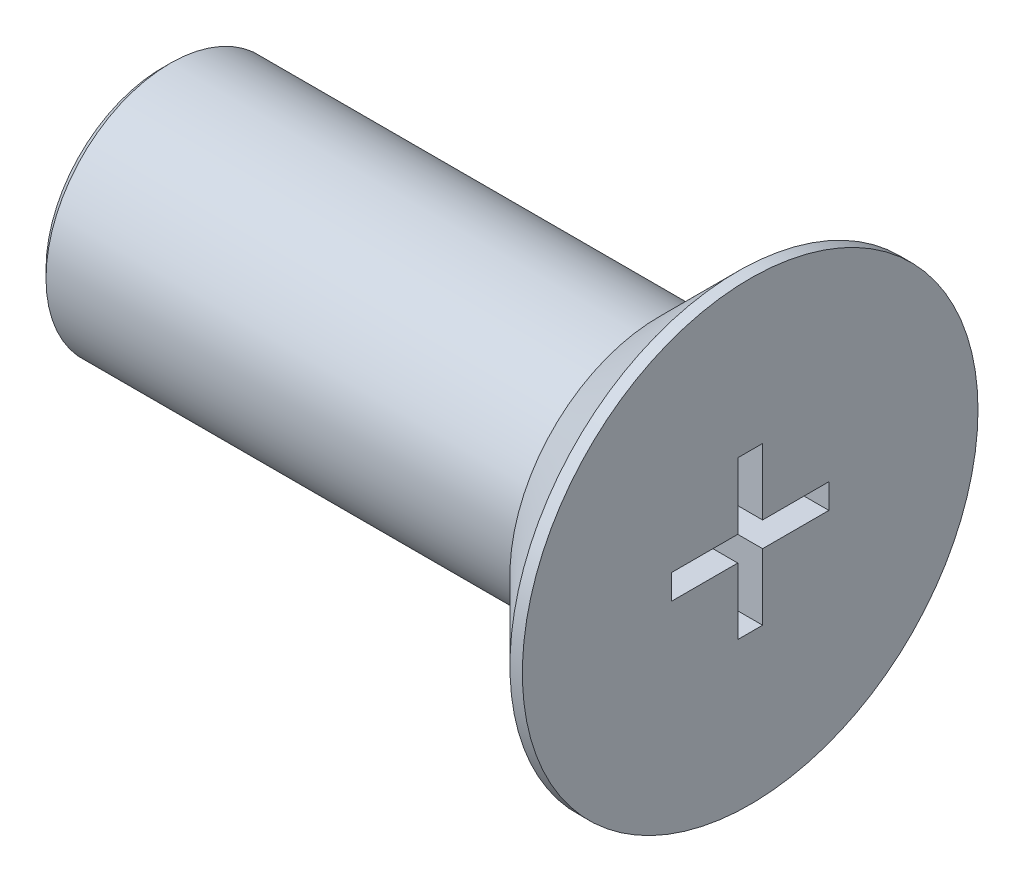
ISO-10303-21;
HEADER;
FILE_DESCRIPTION(('STEP AP214'),'2;1');
FILE_NAME('part.step','',(''),(''),'','','');
FILE_SCHEMA(('AUTOMOTIVE_DESIGN { 1 0 10303 214 1 1 1 1 }'));
ENDSEC;
DATA;
#1=APPLICATION_CONTEXT('core data for automotive mechanical design processes');
#2=APPLICATION_PROTOCOL_DEFINITION('international standard','automotive_design',2000,#1);
#3=PRODUCT_CONTEXT('',#1,'mechanical');
#4=PRODUCT('Part','Part','',(#3));
#5=PRODUCT_RELATED_PRODUCT_CATEGORY('part','',(#4));
#6=PRODUCT_DEFINITION_FORMATION('','',#4);
#7=PRODUCT_DEFINITION_CONTEXT('part definition',#1,'design');
#8=PRODUCT_DEFINITION('design','',#6,#7);
#9=PRODUCT_DEFINITION_SHAPE('','',#8);
#10=(LENGTH_UNIT() NAMED_UNIT(*) SI_UNIT(.MILLI.,.METRE.));
#11=(NAMED_UNIT(*) PLANE_ANGLE_UNIT() SI_UNIT($,.RADIAN.));
#12=(NAMED_UNIT(*) SI_UNIT($,.STERADIAN.) SOLID_ANGLE_UNIT());
#13=UNCERTAINTY_MEASURE_WITH_UNIT(LENGTH_MEASURE(1.E-05),#10,'distance_accuracy_value','');
#14=(GEOMETRIC_REPRESENTATION_CONTEXT(3) GLOBAL_UNCERTAINTY_ASSIGNED_CONTEXT((#13)) GLOBAL_UNIT_ASSIGNED_CONTEXT((#10,
#11,#12)) REPRESENTATION_CONTEXT('',''));
#15=CARTESIAN_POINT('',(0.,0.,0.));
#16=DIRECTION('',(0.,0.,1.));
#17=DIRECTION('',(1.,0.,0.));
#18=AXIS2_PLACEMENT_3D('',#15,#16,#17);
#19=CARTESIAN_POINT('',(0.,0.,0.));
#20=DIRECTION('',(1.,0.,0.));
#21=DIRECTION('',(0.,0.,-1.));
#22=AXIS2_PLACEMENT_3D('',#19,#20,#21);
#23=PLANE('',#22);
#24=CARTESIAN_POINT('',(0.,0.,0.));
#25=DIRECTION('',(1.,0.,0.));
#26=DIRECTION('',(0.,0.,-1.));
#27=AXIS2_PLACEMENT_3D('',#24,#25,#26);
#28=CIRCLE('',#27,3.6);
#29=CARTESIAN_POINT('',(0.,0.,-3.6));
#30=VERTEX_POINT('',#29);
#31=EDGE_CURVE('E11',#30,#30,#28,.F.);
#32=ORIENTED_EDGE('',*,*,#31,.T.);
#33=EDGE_LOOP('',(#32));
#34=FACE_BOUND('',#33,.T.);
#35=CARTESIAN_POINT('',(0.,0.,0.));
#36=DIRECTION('',(1.,0.,0.));
#37=DIRECTION('',(0.,0.,-1.));
#38=AXIS2_PLACEMENT_3D('',#35,#36,#37);
#39=CIRCLE('',#38,3.);
#40=CARTESIAN_POINT('',(0.,0.,-3.));
#41=VERTEX_POINT('',#40);
#42=EDGE_CURVE('E213',#41,#41,#39,.F.);
#43=ORIENTED_EDGE('',*,*,#42,.F.);
#44=EDGE_LOOP('',(#43));
#45=FACE_BOUND('',#44,.T.);
#46=ADVANCED_FACE('F37',(#34,#45),#23,.F.);
#47=CARTESIAN_POINT('',(2.2,0.,0.));
#48=DIRECTION('',(-1.,0.,0.));
#49=DIRECTION('',(0.,0.,1.));
#50=AXIS2_PLACEMENT_3D('',#47,#48,#49);
#51=CYLINDRICAL_SURFACE('',#50,5.5);
#52=CARTESIAN_POINT('',(1.9,0.,0.));
#53=DIRECTION('',(1.,0.,0.));
#54=DIRECTION('',(0.,0.,-1.));
#55=AXIS2_PLACEMENT_3D('',#52,#53,#54);
#56=CIRCLE('',#55,5.5);
#57=CARTESIAN_POINT('',(1.9,0.,-5.5));
#58=VERTEX_POINT('',#57);
#59=EDGE_CURVE('E45',#58,#58,#56,.T.);
#60=ORIENTED_EDGE('',*,*,#59,.T.);
#61=EDGE_LOOP('',(#60));
#62=FACE_BOUND('',#61,.T.);
#63=CARTESIAN_POINT('',(2.2,0.,0.));
#64=DIRECTION('',(1.,0.,0.));
#65=DIRECTION('',(0.,0.,-1.));
#66=AXIS2_PLACEMENT_3D('',#63,#64,#65);
#67=CIRCLE('',#66,5.5);
#68=CARTESIAN_POINT('',(2.2,0.,-5.5));
#69=VERTEX_POINT('',#68);
#70=EDGE_CURVE('E193',#69,#69,#67,.T.);
#71=ORIENTED_EDGE('',*,*,#70,.F.);
#72=EDGE_LOOP('',(#71));
#73=FACE_BOUND('',#72,.T.);
#74=ADVANCED_FACE('F224',(#62,#73),#51,.T.);
#75=CARTESIAN_POINT('',(2.2,0.,0.));
#76=DIRECTION('',(1.,0.,0.));
#77=DIRECTION('',(0.,0.,-1.));
#78=AXIS2_PLACEMENT_3D('',#75,#76,#77);
#79=PLANE('',#78);
#80=DIRECTION('',(0.,1.,0.));
#81=VECTOR('',#80,1.);
#82=CARTESIAN_POINT('',(2.2,1.9,-0.3));
#83=LINE('',#82,#81);
#84=CARTESIAN_POINT('',(2.2,0.3,-0.3));
#85=VERTEX_POINT('',#84);
#86=CARTESIAN_POINT('',(2.2,1.9,-0.3));
#87=VERTEX_POINT('',#86);
#88=EDGE_CURVE('E52',#85,#87,#83,.T.);
#89=ORIENTED_EDGE('',*,*,#88,.F.);
#90=DIRECTION('',(0.,0.,1.));
#91=VECTOR('',#90,1.);
#92=CARTESIAN_POINT('',(2.2,0.3,-0.3));
#93=LINE('',#92,#91);
#94=CARTESIAN_POINT('',(2.2,0.3,-1.9));
#95=VERTEX_POINT('',#94);
#96=EDGE_CURVE('E189',#95,#85,#93,.T.);
#97=ORIENTED_EDGE('',*,*,#96,.F.);
#98=DIRECTION('',(0.,1.,0.));
#99=VECTOR('',#98,1.);
#100=CARTESIAN_POINT('',(2.2,0.3,-1.9));
#101=LINE('',#100,#99);
#102=CARTESIAN_POINT('',(2.2,-0.3,-1.9));
#103=VERTEX_POINT('',#102);
#104=EDGE_CURVE('E187',#103,#95,#101,.T.);
#105=ORIENTED_EDGE('',*,*,#104,.F.);
#106=DIRECTION('',(0.,0.,-1.));
#107=VECTOR('',#106,1.);
#108=CARTESIAN_POINT('',(2.2,-0.3,-1.9));
#109=LINE('',#108,#107);
#110=CARTESIAN_POINT('',(2.2,-0.3,-0.3));
#111=VERTEX_POINT('',#110);
#112=EDGE_CURVE('E136',#111,#103,#109,.T.);
#113=ORIENTED_EDGE('',*,*,#112,.F.);
#114=DIRECTION('',(0.,1.,0.));
#115=VECTOR('',#114,1.);
#116=CARTESIAN_POINT('',(2.2,-0.3,-0.3));
#117=LINE('',#116,#115);
#118=CARTESIAN_POINT('',(2.2,-1.9,-0.3));
#119=VERTEX_POINT('',#118);
#120=EDGE_CURVE('E183',#119,#111,#117,.T.);
#121=ORIENTED_EDGE('',*,*,#120,.F.);
#122=DIRECTION('',(0.,0.,-1.));
#123=VECTOR('',#122,1.);
#124=CARTESIAN_POINT('',(2.2,-1.9,-0.3));
#125=LINE('',#124,#123);
#126=CARTESIAN_POINT('',(2.2,-1.9,0.3));
#127=VERTEX_POINT('',#126);
#128=EDGE_CURVE('E180',#127,#119,#125,.T.);
#129=ORIENTED_EDGE('',*,*,#128,.F.);
#130=DIRECTION('',(0.,-1.,0.));
#131=VECTOR('',#130,1.);
#132=CARTESIAN_POINT('',(2.2,-1.9,0.3));
#133=LINE('',#132,#131);
#134=CARTESIAN_POINT('',(2.2,-0.3,0.3));
#135=VERTEX_POINT('',#134);
#136=EDGE_CURVE('E177',#135,#127,#133,.T.);
#137=ORIENTED_EDGE('',*,*,#136,.F.);
#138=DIRECTION('',(0.,0.,-1.));
#139=VECTOR('',#138,1.);
#140=CARTESIAN_POINT('',(2.2,-0.3,0.3));
#141=LINE('',#140,#139);
#142=CARTESIAN_POINT('',(2.2,-0.3,1.9));
#143=VERTEX_POINT('',#142);
#144=EDGE_CURVE('E174',#143,#135,#141,.T.);
#145=ORIENTED_EDGE('',*,*,#144,.F.);
#146=DIRECTION('',(0.,-1.,0.));
#147=VECTOR('',#146,1.);
#148=CARTESIAN_POINT('',(2.2,-0.3,1.9));
#149=LINE('',#148,#147);
#150=CARTESIAN_POINT('',(2.2,0.3,1.9));
#151=VERTEX_POINT('',#150);
#152=EDGE_CURVE('E171',#151,#143,#149,.T.);
#153=ORIENTED_EDGE('',*,*,#152,.F.);
#154=DIRECTION('',(0.,0.,1.));
#155=VECTOR('',#154,1.);
#156=CARTESIAN_POINT('',(2.2,0.3,1.9));
#157=LINE('',#156,#155);
#158=CARTESIAN_POINT('',(2.2,0.3,0.3));
#159=VERTEX_POINT('',#158);
#160=EDGE_CURVE('E168',#159,#151,#157,.T.);
#161=ORIENTED_EDGE('',*,*,#160,.F.);
#162=DIRECTION('',(0.,-1.,0.));
#163=VECTOR('',#162,1.);
#164=CARTESIAN_POINT('',(2.2,0.3,0.3));
#165=LINE('',#164,#163);
#166=CARTESIAN_POINT('',(2.2,1.9,0.3));
#167=VERTEX_POINT('',#166);
#168=EDGE_CURVE('E165',#167,#159,#165,.T.);
#169=ORIENTED_EDGE('',*,*,#168,.F.);
#170=DIRECTION('',(0.,0.,1.));
#171=VECTOR('',#170,1.);
#172=CARTESIAN_POINT('',(2.2,1.9,0.3));
#173=LINE('',#172,#171);
#174=EDGE_CURVE('E162',#87,#167,#173,.T.);
#175=ORIENTED_EDGE('',*,*,#174,.F.);
#176=EDGE_LOOP('',(#89,#97,#105,#113,#121,#129,#137,#145,#153,#161,#169,#175));
#177=FACE_BOUND('',#176,.T.);
#178=ORIENTED_EDGE('',*,*,#70,.T.);
#179=EDGE_LOOP('',(#178));
#180=FACE_BOUND('',#179,.T.);
#181=ADVANCED_FACE('F246',(#177,#180),#79,.T.);
#182=CARTESIAN_POINT('',(-12.,0.,0.));
#183=DIRECTION('',(1.,0.,0.));
#184=DIRECTION('',(0.,0.,-1.));
#185=AXIS2_PLACEMENT_3D('',#182,#183,#184);
#186=CYLINDRICAL_SURFACE('',#185,3.);
#187=CARTESIAN_POINT('',(-11.8,0.,0.));
#188=DIRECTION('',(-1.,0.,0.));
#189=DIRECTION('',(0.,0.,1.));
#190=AXIS2_PLACEMENT_3D('',#187,#188,#189);
#191=CIRCLE('',#190,3.);
#192=CARTESIAN_POINT('',(-11.8,0.,3.));
#193=VERTEX_POINT('',#192);
#194=EDGE_CURVE('E219',#193,#193,#191,.F.);
#195=ORIENTED_EDGE('',*,*,#194,.T.);
#196=EDGE_LOOP('',(#195));
#197=FACE_BOUND('',#196,.T.);
#198=ORIENTED_EDGE('',*,*,#42,.T.);
#199=EDGE_LOOP('',(#198));
#200=FACE_BOUND('',#199,.T.);
#201=ADVANCED_FACE('F252',(#197,#200),#186,.T.);
#202=CARTESIAN_POINT('',(-12.,0.,0.));
#203=DIRECTION('',(-1.,0.,0.));
#204=DIRECTION('',(0.,0.,1.));
#205=AXIS2_PLACEMENT_3D('',#202,#203,#204);
#206=PLANE('',#205);
#207=CARTESIAN_POINT('',(-12.,0.,0.));
#208=DIRECTION('',(-1.,0.,0.));
#209=DIRECTION('',(0.,0.,1.));
#210=AXIS2_PLACEMENT_3D('',#207,#208,#209);
#211=CIRCLE('',#210,2.8);
#212=CARTESIAN_POINT('',(-12.,0.,2.8));
#213=VERTEX_POINT('',#212);
#214=EDGE_CURVE('E216',#213,#213,#211,.T.);
#215=ORIENTED_EDGE('',*,*,#214,.T.);
#216=EDGE_LOOP('',(#215));
#217=FACE_BOUND('',#216,.T.);
#218=ADVANCED_FACE('F237',(#217),#206,.T.);
#219=CARTESIAN_POINT('',(-12.,0.,0.));
#220=DIRECTION('',(1.,0.,0.));
#221=DIRECTION('',(0.,0.,-1.));
#222=AXIS2_PLACEMENT_3D('',#219,#220,#221);
#223=CONICAL_SURFACE('',#222,2.8,0.785398163397452);
#224=ORIENTED_EDGE('',*,*,#194,.F.);
#225=EDGE_LOOP('',(#224));
#226=FACE_BOUND('',#225,.T.);
#227=ORIENTED_EDGE('',*,*,#214,.F.);
#228=EDGE_LOOP('',(#227));
#229=FACE_BOUND('',#228,.T.);
#230=ADVANCED_FACE('F229',(#226,#229),#223,.T.);
#231=CARTESIAN_POINT('',(1.9,0.,0.));
#232=DIRECTION('',(1.,0.,0.));
#233=DIRECTION('',(0.,0.,-1.));
#234=AXIS2_PLACEMENT_3D('',#231,#232,#233);
#235=CONICAL_SURFACE('',#234,5.5,0.785398163397449);
#236=ORIENTED_EDGE('',*,*,#31,.F.);
#237=EDGE_LOOP('',(#236));
#238=FACE_BOUND('',#237,.T.);
#239=ORIENTED_EDGE('',*,*,#59,.F.);
#240=EDGE_LOOP('',(#239));
#241=FACE_BOUND('',#240,.T.);
#242=ADVANCED_FACE('F39',(#238,#241),#235,.T.);
#243=CARTESIAN_POINT('',(-0.8,1.9,-0.3));
#244=DIRECTION('',(0.,0.,-1.));
#245=DIRECTION('',(0.,1.,0.));
#246=AXIS2_PLACEMENT_3D('',#243,#244,#245);
#247=PLANE('',#246);
#248=ORIENTED_EDGE('',*,*,#88,.T.);
#249=DIRECTION('',(1.,0.,0.));
#250=VECTOR('',#249,1.);
#251=CARTESIAN_POINT('',(-0.8,1.9,-0.3));
#252=LINE('',#251,#250);
#253=CARTESIAN_POINT('',(-0.8,1.9,-0.3));
#254=VERTEX_POINT('',#253);
#255=EDGE_CURVE('E100',#254,#87,#252,.T.);
#256=ORIENTED_EDGE('',*,*,#255,.F.);
#257=DIRECTION('',(0.,1.,0.));
#258=VECTOR('',#257,1.);
#259=CARTESIAN_POINT('',(-0.8,1.9,-0.3));
#260=LINE('',#259,#258);
#261=CARTESIAN_POINT('',(-0.8,0.3,-0.3));
#262=VERTEX_POINT('',#261);
#263=EDGE_CURVE('E191',#262,#254,#260,.T.);
#264=ORIENTED_EDGE('',*,*,#263,.F.);
#265=DIRECTION('',(1.,0.,0.));
#266=VECTOR('',#265,1.);
#267=CARTESIAN_POINT('',(-0.8,0.3,-0.3));
#268=LINE('',#267,#266);
#269=EDGE_CURVE('E60',#262,#85,#268,.T.);
#270=ORIENTED_EDGE('',*,*,#269,.T.);
#271=EDGE_LOOP('',(#248,#256,#264,#270));
#272=FACE_BOUND('',#271,.T.);
#273=ADVANCED_FACE('F228',(#272),#247,.F.);
#274=CARTESIAN_POINT('',(-0.8,0.3,-0.3));
#275=DIRECTION('',(0.,1.,0.));
#276=DIRECTION('',(0.,0.,1.));
#277=AXIS2_PLACEMENT_3D('',#274,#275,#276);
#278=PLANE('',#277);
#279=ORIENTED_EDGE('',*,*,#96,.T.);
#280=ORIENTED_EDGE('',*,*,#269,.F.);
#281=DIRECTION('',(0.,0.,1.));
#282=VECTOR('',#281,1.);
#283=CARTESIAN_POINT('',(-0.8,0.3,-0.3));
#284=LINE('',#283,#282);
#285=CARTESIAN_POINT('',(-0.8,0.3,-1.9));
#286=VERTEX_POINT('',#285);
#287=EDGE_CURVE('E148',#286,#262,#284,.T.);
#288=ORIENTED_EDGE('',*,*,#287,.F.);
#289=DIRECTION('',(1.,0.,0.));
#290=VECTOR('',#289,1.);
#291=CARTESIAN_POINT('',(-0.8,0.3,-1.9));
#292=LINE('',#291,#290);
#293=EDGE_CURVE('E140',#286,#95,#292,.T.);
#294=ORIENTED_EDGE('',*,*,#293,.T.);
#295=EDGE_LOOP('',(#279,#280,#288,#294));
#296=FACE_BOUND('',#295,.T.);
#297=ADVANCED_FACE('F235',(#296),#278,.F.);
#298=CARTESIAN_POINT('',(-0.8,0.3,-1.9));
#299=DIRECTION('',(0.,0.,-1.));
#300=DIRECTION('',(-1.,0.,0.));
#301=AXIS2_PLACEMENT_3D('',#298,#299,#300);
#302=PLANE('',#301);
#303=ORIENTED_EDGE('',*,*,#104,.T.);
#304=ORIENTED_EDGE('',*,*,#293,.F.);
#305=DIRECTION('',(0.,1.,0.));
#306=VECTOR('',#305,1.);
#307=CARTESIAN_POINT('',(-0.8,0.3,-1.9));
#308=LINE('',#307,#306);
#309=CARTESIAN_POINT('',(-0.8,-0.3,-1.9));
#310=VERTEX_POINT('',#309);
#311=EDGE_CURVE('E144',#310,#286,#308,.T.);
#312=ORIENTED_EDGE('',*,*,#311,.F.);
#313=DIRECTION('',(1.,0.,0.));
#314=VECTOR('',#313,1.);
#315=CARTESIAN_POINT('',(-0.8,-0.3,-1.9));
#316=LINE('',#315,#314);
#317=EDGE_CURVE('E129',#310,#103,#316,.T.);
#318=ORIENTED_EDGE('',*,*,#317,.T.);
#319=EDGE_LOOP('',(#303,#304,#312,#318));
#320=FACE_BOUND('',#319,.T.);
#321=ADVANCED_FACE('F145',(#320),#302,.F.);
#322=CARTESIAN_POINT('',(-0.8,-0.3,-1.9));
#323=DIRECTION('',(0.,-1.,0.));
#324=DIRECTION('',(0.,0.,-1.));
#325=AXIS2_PLACEMENT_3D('',#322,#323,#324);
#326=PLANE('',#325);
#327=ORIENTED_EDGE('',*,*,#112,.T.);
#328=ORIENTED_EDGE('',*,*,#317,.F.);
#329=DIRECTION('',(0.,0.,-1.));
#330=VECTOR('',#329,1.);
#331=CARTESIAN_POINT('',(-0.8,-0.3,-1.9));
#332=LINE('',#331,#330);
#333=CARTESIAN_POINT('',(-0.8,-0.3,-0.3));
#334=VERTEX_POINT('',#333);
#335=EDGE_CURVE('E133',#334,#310,#332,.T.);
#336=ORIENTED_EDGE('',*,*,#335,.F.);
#337=DIRECTION('',(1.,0.,0.));
#338=VECTOR('',#337,1.);
#339=CARTESIAN_POINT('',(-0.8,-0.3,-0.3));
#340=LINE('',#339,#338);
#341=EDGE_CURVE('E141',#334,#111,#340,.T.);
#342=ORIENTED_EDGE('',*,*,#341,.T.);
#343=EDGE_LOOP('',(#327,#328,#336,#342));
#344=FACE_BOUND('',#343,.T.);
#345=ADVANCED_FACE('F131',(#344),#326,.F.);
#346=CARTESIAN_POINT('',(-0.8,-0.3,-0.3));
#347=DIRECTION('',(0.,0.,-1.));
#348=DIRECTION('',(0.,1.,0.));
#349=AXIS2_PLACEMENT_3D('',#346,#347,#348);
#350=PLANE('',#349);
#351=ORIENTED_EDGE('',*,*,#120,.T.);
#352=ORIENTED_EDGE('',*,*,#341,.F.);
#353=DIRECTION('',(0.,1.,0.));
#354=VECTOR('',#353,1.);
#355=CARTESIAN_POINT('',(-0.8,-0.3,-0.3));
#356=LINE('',#355,#354);
#357=CARTESIAN_POINT('',(-0.8,-1.9,-0.3));
#358=VERTEX_POINT('',#357);
#359=EDGE_CURVE('E154',#358,#334,#356,.T.);
#360=ORIENTED_EDGE('',*,*,#359,.F.);
#361=DIRECTION('',(1.,0.,0.));
#362=VECTOR('',#361,1.);
#363=CARTESIAN_POINT('',(-0.8,-1.9,-0.3));
#364=LINE('',#363,#362);
#365=EDGE_CURVE('E196',#358,#119,#364,.T.);
#366=ORIENTED_EDGE('',*,*,#365,.T.);
#367=EDGE_LOOP('',(#351,#352,#360,#366));
#368=FACE_BOUND('',#367,.T.);
#369=ADVANCED_FACE('F287',(#368),#350,.F.);
#370=CARTESIAN_POINT('',(-0.8,-1.9,-0.3));
#371=DIRECTION('',(0.,-1.,0.));
#372=DIRECTION('',(0.,0.,-1.));
#373=AXIS2_PLACEMENT_3D('',#370,#371,#372);
#374=PLANE('',#373);
#375=ORIENTED_EDGE('',*,*,#128,.T.);
#376=ORIENTED_EDGE('',*,*,#365,.F.);
#377=DIRECTION('',(0.,0.,-1.));
#378=VECTOR('',#377,1.);
#379=CARTESIAN_POINT('',(-0.8,-1.9,-0.3));
#380=LINE('',#379,#378);
#381=CARTESIAN_POINT('',(-0.8,-1.9,0.3));
#382=VERTEX_POINT('',#381);
#383=EDGE_CURVE('E156',#382,#358,#380,.T.);
#384=ORIENTED_EDGE('',*,*,#383,.F.);
#385=DIRECTION('',(1.,0.,0.));
#386=VECTOR('',#385,1.);
#387=CARTESIAN_POINT('',(-0.8,-1.9,0.3));
#388=LINE('',#387,#386);
#389=EDGE_CURVE('E198',#382,#127,#388,.T.);
#390=ORIENTED_EDGE('',*,*,#389,.T.);
#391=EDGE_LOOP('',(#375,#376,#384,#390));
#392=FACE_BOUND('',#391,.T.);
#393=ADVANCED_FACE('F283',(#392),#374,.F.);
#394=CARTESIAN_POINT('',(-0.8,-1.9,0.3));
#395=DIRECTION('',(0.,0.,1.));
#396=DIRECTION('',(0.,-1.,0.));
#397=AXIS2_PLACEMENT_3D('',#394,#395,#396);
#398=PLANE('',#397);
#399=ORIENTED_EDGE('',*,*,#136,.T.);
#400=ORIENTED_EDGE('',*,*,#389,.F.);
#401=DIRECTION('',(0.,-1.,0.));
#402=VECTOR('',#401,1.);
#403=CARTESIAN_POINT('',(-0.8,-1.9,0.3));
#404=LINE('',#403,#402);
#405=CARTESIAN_POINT('',(-0.8,-0.3,0.3));
#406=VERTEX_POINT('',#405);
#407=EDGE_CURVE('E442',#406,#382,#404,.T.);
#408=ORIENTED_EDGE('',*,*,#407,.F.);
#409=DIRECTION('',(1.,0.,0.));
#410=VECTOR('',#409,1.);
#411=CARTESIAN_POINT('',(-0.8,-0.3,0.3));
#412=LINE('',#411,#410);
#413=EDGE_CURVE('E200',#406,#135,#412,.T.);
#414=ORIENTED_EDGE('',*,*,#413,.T.);
#415=EDGE_LOOP('',(#399,#400,#408,#414));
#416=FACE_BOUND('',#415,.T.);
#417=ADVANCED_FACE('F279',(#416),#398,.F.);
#418=CARTESIAN_POINT('',(-0.8,-0.3,0.3));
#419=DIRECTION('',(0.,-1.,0.));
#420=DIRECTION('',(0.,0.,-1.));
#421=AXIS2_PLACEMENT_3D('',#418,#419,#420);
#422=PLANE('',#421);
#423=ORIENTED_EDGE('',*,*,#144,.T.);
#424=ORIENTED_EDGE('',*,*,#413,.F.);
#425=DIRECTION('',(0.,0.,-1.));
#426=VECTOR('',#425,1.);
#427=CARTESIAN_POINT('',(-0.8,-0.3,0.3));
#428=LINE('',#427,#426);
#429=CARTESIAN_POINT('',(-0.8,-0.3,1.9));
#430=VERTEX_POINT('',#429);
#431=EDGE_CURVE('E439',#430,#406,#428,.T.);
#432=ORIENTED_EDGE('',*,*,#431,.F.);
#433=DIRECTION('',(1.,0.,0.));
#434=VECTOR('',#433,1.);
#435=CARTESIAN_POINT('',(-0.8,-0.3,1.9));
#436=LINE('',#435,#434);
#437=EDGE_CURVE('E202',#430,#143,#436,.T.);
#438=ORIENTED_EDGE('',*,*,#437,.T.);
#439=EDGE_LOOP('',(#423,#424,#432,#438));
#440=FACE_BOUND('',#439,.T.);
#441=ADVANCED_FACE('F275',(#440),#422,.F.);
#442=CARTESIAN_POINT('',(-0.8,-0.3,1.9));
#443=DIRECTION('',(0.,0.,1.));
#444=DIRECTION('',(1.,0.,0.));
#445=AXIS2_PLACEMENT_3D('',#442,#443,#444);
#446=PLANE('',#445);
#447=ORIENTED_EDGE('',*,*,#152,.T.);
#448=ORIENTED_EDGE('',*,*,#437,.F.);
#449=DIRECTION('',(0.,-1.,0.));
#450=VECTOR('',#449,1.);
#451=CARTESIAN_POINT('',(-0.8,-0.3,1.9));
#452=LINE('',#451,#450);
#453=CARTESIAN_POINT('',(-0.8,0.3,1.9));
#454=VERTEX_POINT('',#453);
#455=EDGE_CURVE('E436',#454,#430,#452,.T.);
#456=ORIENTED_EDGE('',*,*,#455,.F.);
#457=DIRECTION('',(1.,0.,0.));
#458=VECTOR('',#457,1.);
#459=CARTESIAN_POINT('',(-0.8,0.3,1.9));
#460=LINE('',#459,#458);
#461=EDGE_CURVE('E204',#454,#151,#460,.T.);
#462=ORIENTED_EDGE('',*,*,#461,.T.);
#463=EDGE_LOOP('',(#447,#448,#456,#462));
#464=FACE_BOUND('',#463,.T.);
#465=ADVANCED_FACE('F271',(#464),#446,.F.);
#466=CARTESIAN_POINT('',(-0.8,0.3,1.9));
#467=DIRECTION('',(0.,1.,0.));
#468=DIRECTION('',(0.,0.,1.));
#469=AXIS2_PLACEMENT_3D('',#466,#467,#468);
#470=PLANE('',#469);
#471=ORIENTED_EDGE('',*,*,#160,.T.);
#472=ORIENTED_EDGE('',*,*,#461,.F.);
#473=DIRECTION('',(0.,0.,1.));
#474=VECTOR('',#473,1.);
#475=CARTESIAN_POINT('',(-0.8,0.3,1.9));
#476=LINE('',#475,#474);
#477=CARTESIAN_POINT('',(-0.8,0.3,0.3));
#478=VERTEX_POINT('',#477);
#479=EDGE_CURVE('E433',#478,#454,#476,.T.);
#480=ORIENTED_EDGE('',*,*,#479,.F.);
#481=DIRECTION('',(1.,0.,0.));
#482=VECTOR('',#481,1.);
#483=CARTESIAN_POINT('',(-0.8,0.3,0.3));
#484=LINE('',#483,#482);
#485=EDGE_CURVE('E206',#478,#159,#484,.T.);
#486=ORIENTED_EDGE('',*,*,#485,.T.);
#487=EDGE_LOOP('',(#471,#472,#480,#486));
#488=FACE_BOUND('',#487,.T.);
#489=ADVANCED_FACE('F267',(#488),#470,.F.);
#490=CARTESIAN_POINT('',(-0.8,0.3,0.3));
#491=DIRECTION('',(0.,0.,1.));
#492=DIRECTION('',(0.,-1.,0.));
#493=AXIS2_PLACEMENT_3D('',#490,#491,#492);
#494=PLANE('',#493);
#495=ORIENTED_EDGE('',*,*,#168,.T.);
#496=ORIENTED_EDGE('',*,*,#485,.F.);
#497=DIRECTION('',(0.,-1.,0.));
#498=VECTOR('',#497,1.);
#499=CARTESIAN_POINT('',(-0.8,0.3,0.3));
#500=LINE('',#499,#498);
#501=CARTESIAN_POINT('',(-0.8,1.9,0.3));
#502=VERTEX_POINT('',#501);
#503=EDGE_CURVE('E428',#502,#478,#500,.T.);
#504=ORIENTED_EDGE('',*,*,#503,.F.);
#505=DIRECTION('',(1.,0.,0.));
#506=VECTOR('',#505,1.);
#507=CARTESIAN_POINT('',(-0.8,1.9,0.3));
#508=LINE('',#507,#506);
#509=EDGE_CURVE('E208',#502,#167,#508,.T.);
#510=ORIENTED_EDGE('',*,*,#509,.T.);
#511=EDGE_LOOP('',(#495,#496,#504,#510));
#512=FACE_BOUND('',#511,.T.);
#513=ADVANCED_FACE('F263',(#512),#494,.F.);
#514=CARTESIAN_POINT('',(-0.8,1.9,0.3));
#515=DIRECTION('',(0.,1.,0.));
#516=DIRECTION('',(0.,0.,1.));
#517=AXIS2_PLACEMENT_3D('',#514,#515,#516);
#518=PLANE('',#517);
#519=ORIENTED_EDGE('',*,*,#174,.T.);
#520=ORIENTED_EDGE('',*,*,#509,.F.);
#521=DIRECTION('',(0.,0.,1.));
#522=VECTOR('',#521,1.);
#523=CARTESIAN_POINT('',(-0.8,1.9,0.3));
#524=LINE('',#523,#522);
#525=EDGE_CURVE('E426',#254,#502,#524,.T.);
#526=ORIENTED_EDGE('',*,*,#525,.F.);
#527=ORIENTED_EDGE('',*,*,#255,.T.);
#528=EDGE_LOOP('',(#519,#520,#526,#527));
#529=FACE_BOUND('',#528,.T.);
#530=ADVANCED_FACE('F260',(#529),#518,.F.);
#531=CARTESIAN_POINT('',(-0.8,0.,0.));
#532=DIRECTION('',(1.,0.,0.));
#533=DIRECTION('',(0.,0.,-1.));
#534=AXIS2_PLACEMENT_3D('',#531,#532,#533);
#535=PLANE('',#534);
#536=ORIENTED_EDGE('',*,*,#263,.T.);
#537=ORIENTED_EDGE('',*,*,#525,.T.);
#538=ORIENTED_EDGE('',*,*,#503,.T.);
#539=ORIENTED_EDGE('',*,*,#479,.T.);
#540=ORIENTED_EDGE('',*,*,#455,.T.);
#541=ORIENTED_EDGE('',*,*,#431,.T.);
#542=ORIENTED_EDGE('',*,*,#407,.T.);
#543=ORIENTED_EDGE('',*,*,#383,.T.);
#544=ORIENTED_EDGE('',*,*,#359,.T.);
#545=ORIENTED_EDGE('',*,*,#335,.T.);
#546=ORIENTED_EDGE('',*,*,#311,.T.);
#547=ORIENTED_EDGE('',*,*,#287,.T.);
#548=EDGE_LOOP('',(#536,#537,#538,#539,#540,#541,#542,#543,#544,#545,#546,#547));
#549=FACE_BOUND('',#548,.T.);
#550=ADVANCED_FACE('F151',(#549),#535,.T.);
#551=CLOSED_SHELL('',(#46,#74,#181,#201,#218,#230,#242,#273,#297,#321,#345,#369,#393,#417,#441,
#465,#489,#513,#530,#550));
#552=MANIFOLD_SOLID_BREP('B2',#551);
#553=ADVANCED_BREP_SHAPE_REPRESENTATION('',(#18,#552),#14);
#554=SHAPE_DEFINITION_REPRESENTATION(#9,#553);
ENDSEC;
END-ISO-10303-21;
